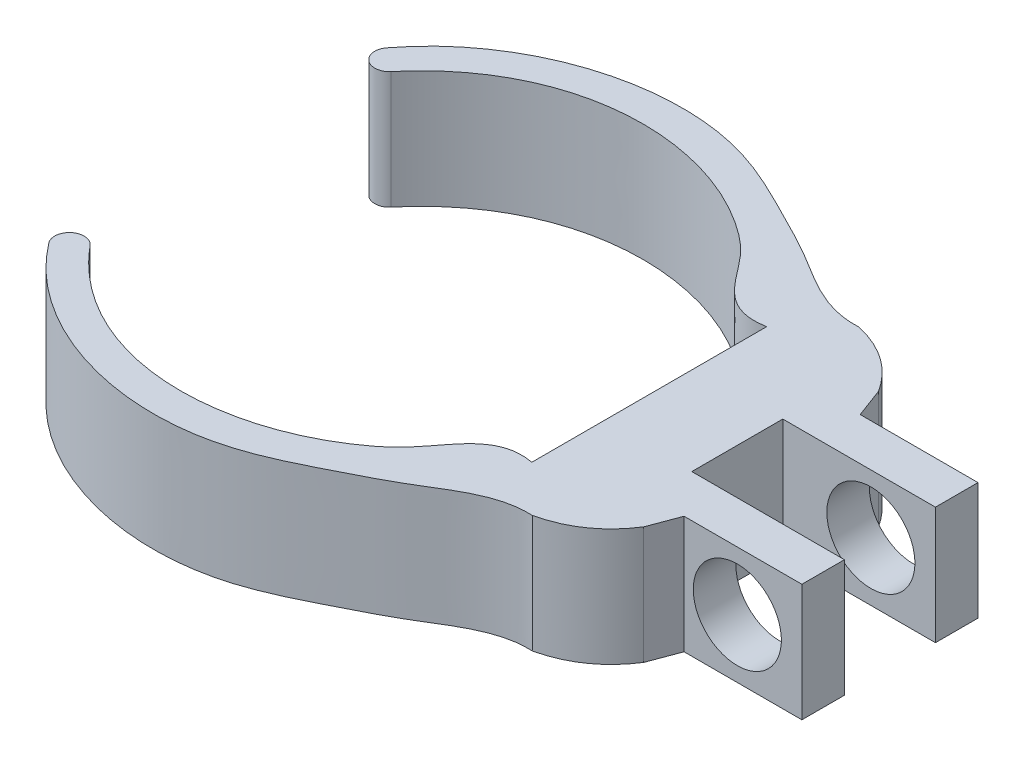
ISO-10303-21;
HEADER;
FILE_DESCRIPTION(('STEP AP214'),'2;1');
FILE_NAME('part.step','',(''),(''),'','','');
FILE_SCHEMA(('AUTOMOTIVE_DESIGN { 1 0 10303 214 1 1 1 1 }'));
ENDSEC;
DATA;
#1=APPLICATION_CONTEXT('core data for automotive mechanical design processes');
#2=APPLICATION_PROTOCOL_DEFINITION('international standard','automotive_design',2000,#1);
#3=PRODUCT_CONTEXT('',#1,'mechanical');
#4=PRODUCT('Part','Part','',(#3));
#5=PRODUCT_RELATED_PRODUCT_CATEGORY('part','',(#4));
#6=PRODUCT_DEFINITION_FORMATION('','',#4);
#7=PRODUCT_DEFINITION_CONTEXT('part definition',#1,'design');
#8=PRODUCT_DEFINITION('design','',#6,#7);
#9=PRODUCT_DEFINITION_SHAPE('','',#8);
#10=(LENGTH_UNIT() NAMED_UNIT(*) SI_UNIT(.MILLI.,.METRE.));
#11=(NAMED_UNIT(*) PLANE_ANGLE_UNIT() SI_UNIT($,.RADIAN.));
#12=(NAMED_UNIT(*) SI_UNIT($,.STERADIAN.) SOLID_ANGLE_UNIT());
#13=UNCERTAINTY_MEASURE_WITH_UNIT(LENGTH_MEASURE(1.E-05),#10,'distance_accuracy_value','');
#14=(GEOMETRIC_REPRESENTATION_CONTEXT(3) GLOBAL_UNCERTAINTY_ASSIGNED_CONTEXT((#13)) GLOBAL_UNIT_ASSIGNED_CONTEXT((#10,
#11,#12)) REPRESENTATION_CONTEXT('',''));
#15=CARTESIAN_POINT('',(0.,0.,0.));
#16=DIRECTION('',(0.,0.,1.));
#17=DIRECTION('',(1.,0.,0.));
#18=AXIS2_PLACEMENT_3D('',#15,#16,#17);
#19=CARTESIAN_POINT('',(0.,4.,-7.));
#20=DIRECTION('',(0.,0.,-1.));
#21=DIRECTION('',(-1.,0.,0.));
#22=AXIS2_PLACEMENT_3D('',#19,#20,#21);
#23=PLANE('',#22);
#24=CARTESIAN_POINT('',(6.,2.,-7.));
#25=DIRECTION('',(0.,0.,-1.));
#26=DIRECTION('',(-1.,0.,0.));
#27=AXIS2_PLACEMENT_3D('',#24,#25,#26);
#28=CIRCLE('',#27,1.5);
#29=CARTESIAN_POINT('',(4.5,2.,-7.));
#30=VERTEX_POINT('',#29);
#31=EDGE_CURVE('E195',#30,#30,#28,.F.);
#32=ORIENTED_EDGE('',*,*,#31,.T.);
#33=EDGE_LOOP('',(#32));
#34=FACE_BOUND('',#33,.T.);
#35=DIRECTION('',(1.,0.,0.));
#36=VECTOR('',#35,1.);
#37=CARTESIAN_POINT('',(0.,0.,-7.));
#38=LINE('',#37,#36);
#39=CARTESIAN_POINT('',(4.18582899350668,0.,-7.));
#40=VERTEX_POINT('',#39);
#41=CARTESIAN_POINT('',(8.2,0.,-7.));
#42=VERTEX_POINT('',#41);
#43=EDGE_CURVE('E192',#40,#42,#38,.T.);
#44=ORIENTED_EDGE('',*,*,#43,.F.);
#45=DIRECTION('',(0.,-1.,0.));
#46=VECTOR('',#45,1.);
#47=CARTESIAN_POINT('',(4.18582899350668,4.,-7.));
#48=LINE('',#47,#46);
#49=CARTESIAN_POINT('',(4.18582899350668,4.,-7.));
#50=VERTEX_POINT('',#49);
#51=EDGE_CURVE('E11',#50,#40,#48,.T.);
#52=ORIENTED_EDGE('',*,*,#51,.F.);
#53=DIRECTION('',(1.,0.,0.));
#54=VECTOR('',#53,1.);
#55=CARTESIAN_POINT('',(0.,4.,-7.));
#56=LINE('',#55,#54);
#57=CARTESIAN_POINT('',(8.2,4.,-7.));
#58=VERTEX_POINT('',#57);
#59=EDGE_CURVE('E268',#50,#58,#56,.T.);
#60=ORIENTED_EDGE('',*,*,#59,.T.);
#61=DIRECTION('',(0.,-1.,0.));
#62=VECTOR('',#61,1.);
#63=CARTESIAN_POINT('',(8.2,4.,-7.));
#64=LINE('',#63,#62);
#65=EDGE_CURVE('E54',#58,#42,#64,.T.);
#66=ORIENTED_EDGE('',*,*,#65,.T.);
#67=EDGE_LOOP('',(#44,#52,#60,#66));
#68=FACE_BOUND('',#67,.T.);
#69=ADVANCED_FACE('F37',(#34,#68),#23,.T.);
#70=CARTESIAN_POINT('',(5.96743312681349,4.,-2.22783787352512));
#71=DIRECTION('',(0.93684171159895,0.,-0.349753638163136));
#72=DIRECTION('',(-0.349753638163136,0.,-0.93684171159895));
#73=AXIS2_PLACEMENT_3D('',#70,#71,#72);
#74=PLANE('',#73);
#75=DIRECTION('',(0.349753638163136,0.,0.93684171159895));
#76=VECTOR('',#75,1.);
#77=CARTESIAN_POINT('',(5.96743312681349,0.,-2.22783787352512));
#78=LINE('',#77,#76);
#79=CARTESIAN_POINT('',(3.81249630151307,0.,-8.));
#80=VERTEX_POINT('',#79);
#81=EDGE_CURVE('E194',#80,#40,#78,.T.);
#82=ORIENTED_EDGE('',*,*,#81,.F.);
#83=DIRECTION('',(0.,-1.,0.));
#84=VECTOR('',#83,1.);
#85=CARTESIAN_POINT('',(3.81249630151307,4.,-8.));
#86=LINE('',#85,#84);
#87=CARTESIAN_POINT('',(3.81249630151307,4.,-8.));
#88=VERTEX_POINT('',#87);
#89=EDGE_CURVE('E46',#88,#80,#86,.T.);
#90=ORIENTED_EDGE('',*,*,#89,.F.);
#91=DIRECTION('',(0.349753638163136,0.,0.93684171159895));
#92=VECTOR('',#91,1.);
#93=CARTESIAN_POINT('',(5.96743312681349,4.,-2.22783787352512));
#94=LINE('',#93,#92);
#95=EDGE_CURVE('E322',#88,#50,#94,.T.);
#96=ORIENTED_EDGE('',*,*,#95,.T.);
#97=ORIENTED_EDGE('',*,*,#51,.T.);
#98=EDGE_LOOP('',(#82,#90,#96,#97));
#99=FACE_BOUND('',#98,.T.);
#100=ADVANCED_FACE('F311',(#99),#74,.T.);
#101=CARTESIAN_POINT('',(1.579778316785,4.,-9.56066150238347));
#102=CARTESIAN_POINT('',(3.01637188256581,4.,-9.23196193005216));
#103=CARTESIAN_POINT('',(3.81249630151308,4.,-8.));
#104=B_SPLINE_CURVE_WITH_KNOTS('',2,(#101,#102,#103),.UNSPECIFIED.,.F.,.F.,(3,3),(0.,1.),.UNSPECIFIED.);
#105=DIRECTION('',(0.,-1.,0.));
#106=VECTOR('',#105,1.);
#107=SURFACE_OF_LINEAR_EXTRUSION('',#104,#106);
#108=CARTESIAN_POINT('',(1.579778316785,0.,-9.56066150238347));
#109=CARTESIAN_POINT('',(3.01637188256581,0.,-9.23196193005216));
#110=CARTESIAN_POINT('',(3.81249630151308,0.,-8.));
#111=B_SPLINE_CURVE_WITH_KNOTS('',2,(#108,#109,#110),.UNSPECIFIED.,.F.,.F.,(3,3),(0.,1.),.UNSPECIFIED.);
#112=CARTESIAN_POINT('',(1.579778316785,0.,-9.56066150238347));
#113=VERTEX_POINT('',#112);
#114=EDGE_CURVE('E198',#113,#80,#111,.T.);
#115=ORIENTED_EDGE('',*,*,#114,.F.);
#116=DIRECTION('',(0.,-1.,0.));
#117=VECTOR('',#116,1.);
#118=CARTESIAN_POINT('',(1.579778316785,4.,-9.56066150238347));
#119=LINE('',#118,#117);
#120=CARTESIAN_POINT('',(1.579778316785,4.,-9.56066150238347));
#121=VERTEX_POINT('',#120);
#122=EDGE_CURVE('E299',#121,#113,#119,.T.);
#123=ORIENTED_EDGE('',*,*,#122,.F.);
#124=EDGE_CURVE('E307',#121,#88,#104,.T.);
#125=ORIENTED_EDGE('',*,*,#124,.T.);
#126=ORIENTED_EDGE('',*,*,#89,.T.);
#127=EDGE_LOOP('',(#115,#123,#125,#126));
#128=FACE_BOUND('',#127,.T.);
#129=ADVANCED_FACE('F305',(#128),#107,.T.);
#130=CARTESIAN_POINT('',(-14.6796449934747,4.,-9.77947622002646));
#131=CARTESIAN_POINT('',(-12.6288944529096,4.,-12.4740809792739));
#132=CARTESIAN_POINT('',(-7.71429631155654,4.,-13.951404509586));
#133=CARTESIAN_POINT('',(-3.34534030952829,4.,-11.740062440401));
#134=CARTESIAN_POINT('',(-1.00563164103133,4.,-10.5601854078919));
#135=CARTESIAN_POINT('',(0.39459532488585,4.,-9.50115309346869));
#136=CARTESIAN_POINT('',(1.579778316785,4.,-9.56066150238347));
#137=B_SPLINE_CURVE_WITH_KNOTS('',3,(#130,#131,#132,#133,#134,#135,#136),.UNSPECIFIED.,.F.,.F.,
(4,1,1,1,4),(0.,0.557352672097069,0.711946672573447,0.815566184702698,1.),.UNSPECIFIED.);
#138=DIRECTION('',(0.,-1.,0.));
#139=VECTOR('',#138,1.);
#140=SURFACE_OF_LINEAR_EXTRUSION('',#137,#139);
#141=CARTESIAN_POINT('',(-14.6796449934747,0.,-9.77947622002646));
#142=CARTESIAN_POINT('',(-12.6288944529096,0.,-12.4740809792739));
#143=CARTESIAN_POINT('',(-7.71429631155654,0.,-13.951404509586));
#144=CARTESIAN_POINT('',(-3.34534030952829,0.,-11.740062440401));
#145=CARTESIAN_POINT('',(-1.00563164103133,0.,-10.5601854078919));
#146=CARTESIAN_POINT('',(0.39459532488585,0.,-9.50115309346869));
#147=CARTESIAN_POINT('',(1.579778316785,0.,-9.56066150238347));
#148=B_SPLINE_CURVE_WITH_KNOTS('',3,(#141,#142,#143,#144,#145,#146,#147),.UNSPECIFIED.,.F.,.F.,
(4,1,1,1,4),(0.,0.557352672097069,0.711946672573447,0.815566184702698,1.),.UNSPECIFIED.);
#149=CARTESIAN_POINT('',(-14.6796449934747,0.,-9.77947622002647));
#150=VERTEX_POINT('',#149);
#151=EDGE_CURVE('E203',#150,#113,#148,.T.);
#152=ORIENTED_EDGE('',*,*,#151,.F.);
#153=DIRECTION('',(0.,-1.,0.));
#154=VECTOR('',#153,1.);
#155=CARTESIAN_POINT('',(-14.6796449934747,4.,-9.77947622002647));
#156=LINE('',#155,#154);
#157=CARTESIAN_POINT('',(-14.6796449934747,4.,-9.77947622002647));
#158=VERTEX_POINT('',#157);
#159=EDGE_CURVE('E297',#158,#150,#156,.T.);
#160=ORIENTED_EDGE('',*,*,#159,.F.);
#161=EDGE_CURVE('E321',#158,#121,#137,.T.);
#162=ORIENTED_EDGE('',*,*,#161,.T.);
#163=ORIENTED_EDGE('',*,*,#122,.T.);
#164=EDGE_LOOP('',(#152,#160,#162,#163));
#165=FACE_BOUND('',#164,.T.);
#166=ADVANCED_FACE('F317',(#165),#140,.T.);
#167=CARTESIAN_POINT('',(-14.301533041483,4.,-9.45231975629542));
#168=DIRECTION('',(0.,-1.,0.));
#169=DIRECTION('',(0.,0.,-1.));
#170=AXIS2_PLACEMENT_3D('',#167,#168,#169);
#171=CYLINDRICAL_SURFACE('',#170,0.499999999999999);
#172=CARTESIAN_POINT('',(-14.301533041483,0.,-9.45231975629542));
#173=DIRECTION('',(0.,1.,0.));
#174=DIRECTION('',(0.,0.,1.));
#175=AXIS2_PLACEMENT_3D('',#172,#173,#174);
#176=CIRCLE('',#175,0.499999999999999);
#177=CARTESIAN_POINT('',(-13.9234210894912,0.,-9.12516329256437));
#178=VERTEX_POINT('',#177);
#179=EDGE_CURVE('E211',#150,#178,#176,.T.);
#180=ORIENTED_EDGE('',*,*,#179,.T.);
#181=DIRECTION('',(0.,-1.,0.));
#182=VECTOR('',#181,1.);
#183=CARTESIAN_POINT('',(-13.9234210894912,4.,-9.12516329256437));
#184=LINE('',#183,#182);
#185=CARTESIAN_POINT('',(-13.9234210894912,4.,-9.12516329256437));
#186=VERTEX_POINT('',#185);
#187=EDGE_CURVE('E295',#186,#178,#184,.T.);
#188=ORIENTED_EDGE('',*,*,#187,.F.);
#189=CARTESIAN_POINT('',(-14.301533041483,4.,-9.45231975629542));
#190=DIRECTION('',(0.,1.,0.));
#191=DIRECTION('',(0.,0.,1.));
#192=AXIS2_PLACEMENT_3D('',#189,#190,#191);
#193=CIRCLE('',#192,0.499999999999999);
#194=EDGE_CURVE('E324',#158,#186,#193,.T.);
#195=ORIENTED_EDGE('',*,*,#194,.F.);
#196=ORIENTED_EDGE('',*,*,#159,.T.);
#197=EDGE_LOOP('',(#180,#188,#195,#196));
#198=FACE_BOUND('',#197,.T.);
#199=ADVANCED_FACE('F447',(#198),#171,.T.);
#200=CARTESIAN_POINT('',(0.,4.,-8.));
#201=CARTESIAN_POINT('',(-1.44497211346418,4.,-7.73163506053914));
#202=CARTESIAN_POINT('',(-1.98977866941509,4.,-9.27479361128934));
#203=CARTESIAN_POINT('',(-5.99641861973722,4.,-12.5324767542509));
#204=CARTESIAN_POINT('',(-11.0435793264746,4.,-12.5964127519181));
#205=CARTESIAN_POINT('',(-13.9234210894912,4.,-9.12516329256436));
#206=B_SPLINE_CURVE_WITH_KNOTS('',3,(#200,#201,#202,#203,#204,#205),.UNSPECIFIED.,.F.,.F.,(4,1,
1,4),(0.,0.216898357421302,0.270831115761617,1.),.UNSPECIFIED.);
#207=DIRECTION('',(0.,-1.,0.));
#208=VECTOR('',#207,1.);
#209=SURFACE_OF_LINEAR_EXTRUSION('',#206,#208);
#210=CARTESIAN_POINT('',(0.,0.,-8.));
#211=CARTESIAN_POINT('',(-1.44497211346418,0.,-7.73163506053914));
#212=CARTESIAN_POINT('',(-1.98977866941509,0.,-9.27479361128934));
#213=CARTESIAN_POINT('',(-5.99641861973722,0.,-12.5324767542509));
#214=CARTESIAN_POINT('',(-11.0435793264746,0.,-12.5964127519181));
#215=CARTESIAN_POINT('',(-13.9234210894912,0.,-9.12516329256436));
#216=B_SPLINE_CURVE_WITH_KNOTS('',3,(#210,#211,#212,#213,#214,#215),.UNSPECIFIED.,.F.,.F.,(4,1,
1,4),(0.,0.216898357421302,0.270831115761617,1.),.UNSPECIFIED.);
#217=CARTESIAN_POINT('',(0.,0.,-8.));
#218=VERTEX_POINT('',#217);
#219=EDGE_CURVE('E217',#218,#178,#216,.T.);
#220=ORIENTED_EDGE('',*,*,#219,.F.);
#221=DIRECTION('',(0.,-1.,0.));
#222=VECTOR('',#221,1.);
#223=CARTESIAN_POINT('',(0.,4.,-8.));
#224=LINE('',#223,#222);
#225=CARTESIAN_POINT('',(0.,4.,-8.));
#226=VERTEX_POINT('',#225);
#227=EDGE_CURVE('E293',#226,#218,#224,.T.);
#228=ORIENTED_EDGE('',*,*,#227,.F.);
#229=EDGE_CURVE('E445',#226,#186,#206,.T.);
#230=ORIENTED_EDGE('',*,*,#229,.T.);
#231=ORIENTED_EDGE('',*,*,#187,.T.);
#232=EDGE_LOOP('',(#220,#228,#230,#231));
#233=FACE_BOUND('',#232,.T.);
#234=ADVANCED_FACE('F440',(#233),#209,.T.);
#235=CARTESIAN_POINT('',(0.,4.,0.));
#236=DIRECTION('',(1.,0.,0.));
#237=DIRECTION('',(0.,0.,-1.));
#238=AXIS2_PLACEMENT_3D('',#235,#236,#237);
#239=PLANE('',#238);
#240=DIRECTION('',(0.,0.,1.));
#241=VECTOR('',#240,1.);
#242=CARTESIAN_POINT('',(0.,0.,0.));
#243=LINE('',#242,#241);
#244=CARTESIAN_POINT('',(0.,0.,0.));
#245=VERTEX_POINT('',#244);
#246=EDGE_CURVE('E222',#218,#245,#243,.T.);
#247=ORIENTED_EDGE('',*,*,#246,.T.);
#248=DIRECTION('',(0.,-1.,0.));
#249=VECTOR('',#248,1.);
#250=CARTESIAN_POINT('',(0.,4.,0.));
#251=LINE('',#250,#249);
#252=CARTESIAN_POINT('',(0.,4.,0.));
#253=VERTEX_POINT('',#252);
#254=EDGE_CURVE('E290',#253,#245,#251,.T.);
#255=ORIENTED_EDGE('',*,*,#254,.F.);
#256=DIRECTION('',(0.,0.,1.));
#257=VECTOR('',#256,1.);
#258=CARTESIAN_POINT('',(0.,4.,0.));
#259=LINE('',#258,#257);
#260=EDGE_CURVE('E448',#226,#253,#259,.T.);
#261=ORIENTED_EDGE('',*,*,#260,.F.);
#262=ORIENTED_EDGE('',*,*,#227,.T.);
#263=EDGE_LOOP('',(#247,#255,#261,#262));
#264=FACE_BOUND('',#263,.T.);
#265=ADVANCED_FACE('F461',(#264),#239,.F.);
#266=CARTESIAN_POINT('',(0.,4.,0.));
#267=CARTESIAN_POINT('',(-1.44497211346418,4.,-0.268364939460865));
#268=CARTESIAN_POINT('',(-1.98977866941509,4.,1.27479361128934));
#269=CARTESIAN_POINT('',(-5.99641861973722,4.,4.53247675425091));
#270=CARTESIAN_POINT('',(-11.0435793264746,4.,4.5964127519181));
#271=CARTESIAN_POINT('',(-13.9234210894912,4.,1.12516329256436));
#272=B_SPLINE_CURVE_WITH_KNOTS('',3,(#266,#267,#268,#269,#270,#271),.UNSPECIFIED.,.F.,.F.,(4,1,
1,4),(0.,0.216898357421302,0.270831115761617,1.),.UNSPECIFIED.);
#273=DIRECTION('',(0.,-1.,0.));
#274=VECTOR('',#273,1.);
#275=SURFACE_OF_LINEAR_EXTRUSION('',#272,#274);
#276=CARTESIAN_POINT('',(0.,0.,0.));
#277=CARTESIAN_POINT('',(-1.44497211346418,0.,-0.268364939460865));
#278=CARTESIAN_POINT('',(-1.98977866941509,0.,1.27479361128934));
#279=CARTESIAN_POINT('',(-5.99641861973722,0.,4.53247675425091));
#280=CARTESIAN_POINT('',(-11.0435793264746,0.,4.5964127519181));
#281=CARTESIAN_POINT('',(-13.9234210894912,0.,1.12516329256436));
#282=B_SPLINE_CURVE_WITH_KNOTS('',3,(#276,#277,#278,#279,#280,#281),.UNSPECIFIED.,.F.,.F.,(4,1,
1,4),(0.,0.216898357421302,0.270831115761617,1.),.UNSPECIFIED.);
#283=CARTESIAN_POINT('',(-13.9234210894912,0.,1.12516329256438));
#284=VERTEX_POINT('',#283);
#285=EDGE_CURVE('E227',#245,#284,#282,.T.);
#286=ORIENTED_EDGE('',*,*,#285,.T.);
#287=DIRECTION('',(0.,-1.,0.));
#288=VECTOR('',#287,1.);
#289=CARTESIAN_POINT('',(-13.9234210894912,4.,1.12516329256438));
#290=LINE('',#289,#288);
#291=CARTESIAN_POINT('',(-13.9234210894912,4.,1.12516329256438));
#292=VERTEX_POINT('',#291);
#293=EDGE_CURVE('E288',#292,#284,#290,.T.);
#294=ORIENTED_EDGE('',*,*,#293,.F.);
#295=EDGE_CURVE('E619',#253,#292,#272,.T.);
#296=ORIENTED_EDGE('',*,*,#295,.F.);
#297=ORIENTED_EDGE('',*,*,#254,.T.);
#298=EDGE_LOOP('',(#286,#294,#296,#297));
#299=FACE_BOUND('',#298,.T.);
#300=ADVANCED_FACE('F434',(#299),#275,.F.);
#301=CARTESIAN_POINT('',(-14.301533041483,4.,1.45231975629542));
#302=DIRECTION('',(0.,-1.,0.));
#303=DIRECTION('',(0.,0.,-1.));
#304=AXIS2_PLACEMENT_3D('',#301,#302,#303);
#305=CYLINDRICAL_SURFACE('',#304,0.499999999999999);
#306=CARTESIAN_POINT('',(-14.301533041483,0.,1.45231975629542));
#307=DIRECTION('',(0.,1.,0.));
#308=DIRECTION('',(0.,0.,1.));
#309=AXIS2_PLACEMENT_3D('',#306,#307,#308);
#310=CIRCLE('',#309,0.499999999999999);
#311=CARTESIAN_POINT('',(-14.6796449934747,0.,1.77947622002647));
#312=VERTEX_POINT('',#311);
#313=EDGE_CURVE('E232',#312,#284,#310,.F.);
#314=ORIENTED_EDGE('',*,*,#313,.F.);
#315=DIRECTION('',(0.,-1.,0.));
#316=VECTOR('',#315,1.);
#317=CARTESIAN_POINT('',(-14.6796449934747,4.,1.77947622002647));
#318=LINE('',#317,#316);
#319=CARTESIAN_POINT('',(-14.6796449934747,4.,1.77947622002647));
#320=VERTEX_POINT('',#319);
#321=EDGE_CURVE('E286',#320,#312,#318,.T.);
#322=ORIENTED_EDGE('',*,*,#321,.F.);
#323=CARTESIAN_POINT('',(-14.301533041483,4.,1.45231975629542));
#324=DIRECTION('',(0.,1.,0.));
#325=DIRECTION('',(0.,0.,1.));
#326=AXIS2_PLACEMENT_3D('',#323,#324,#325);
#327=CIRCLE('',#326,0.499999999999999);
#328=EDGE_CURVE('E431',#320,#292,#327,.F.);
#329=ORIENTED_EDGE('',*,*,#328,.T.);
#330=ORIENTED_EDGE('',*,*,#293,.T.);
#331=EDGE_LOOP('',(#314,#322,#329,#330));
#332=FACE_BOUND('',#331,.T.);
#333=ADVANCED_FACE('F426',(#332),#305,.T.);
#334=CARTESIAN_POINT('',(-14.6796449934747,4.,1.77947622002646));
#335=CARTESIAN_POINT('',(-12.6288944529096,4.,4.4740809792739));
#336=CARTESIAN_POINT('',(-7.71429631155654,4.,5.95140450958604));
#337=CARTESIAN_POINT('',(-3.34534030952829,4.,3.74006244040104));
#338=CARTESIAN_POINT('',(-1.00563164103133,4.,2.56018540789194));
#339=CARTESIAN_POINT('',(0.39459532488585,4.,1.50115309346869));
#340=CARTESIAN_POINT('',(1.579778316785,4.,1.56066150238347));
#341=B_SPLINE_CURVE_WITH_KNOTS('',3,(#334,#335,#336,#337,#338,#339,#340),.UNSPECIFIED.,.F.,.F.,
(4,1,1,1,4),(0.,0.557352672097069,0.711946672573447,0.815566184702698,1.),.UNSPECIFIED.);
#342=DIRECTION('',(0.,-1.,0.));
#343=VECTOR('',#342,1.);
#344=SURFACE_OF_LINEAR_EXTRUSION('',#341,#343);
#345=CARTESIAN_POINT('',(-14.6796449934747,0.,1.77947622002646));
#346=CARTESIAN_POINT('',(-12.6288944529096,0.,4.4740809792739));
#347=CARTESIAN_POINT('',(-7.71429631155654,0.,5.95140450958604));
#348=CARTESIAN_POINT('',(-3.34534030952829,0.,3.74006244040104));
#349=CARTESIAN_POINT('',(-1.00563164103133,0.,2.56018540789194));
#350=CARTESIAN_POINT('',(0.39459532488585,0.,1.50115309346869));
#351=CARTESIAN_POINT('',(1.579778316785,0.,1.56066150238347));
#352=B_SPLINE_CURVE_WITH_KNOTS('',3,(#345,#346,#347,#348,#349,#350,#351),.UNSPECIFIED.,.F.,.F.,
(4,1,1,1,4),(0.,0.557352672097069,0.711946672573447,0.815566184702698,1.),.UNSPECIFIED.);
#353=CARTESIAN_POINT('',(1.579778316785,0.,1.56066150238347));
#354=VERTEX_POINT('',#353);
#355=EDGE_CURVE('E238',#312,#354,#352,.T.);
#356=ORIENTED_EDGE('',*,*,#355,.T.);
#357=DIRECTION('',(0.,-1.,0.));
#358=VECTOR('',#357,1.);
#359=CARTESIAN_POINT('',(1.579778316785,4.,1.56066150238347));
#360=LINE('',#359,#358);
#361=CARTESIAN_POINT('',(1.579778316785,4.,1.56066150238347));
#362=VERTEX_POINT('',#361);
#363=EDGE_CURVE('E283',#362,#354,#360,.T.);
#364=ORIENTED_EDGE('',*,*,#363,.F.);
#365=EDGE_CURVE('E395',#320,#362,#341,.T.);
#366=ORIENTED_EDGE('',*,*,#365,.F.);
#367=ORIENTED_EDGE('',*,*,#321,.T.);
#368=EDGE_LOOP('',(#356,#364,#366,#367));
#369=FACE_BOUND('',#368,.T.);
#370=ADVANCED_FACE('F385',(#369),#344,.F.);
#371=CARTESIAN_POINT('',(1.579778316785,4.,1.56066150238347));
#372=CARTESIAN_POINT('',(3.01637188256581,4.,1.23196193005216));
#373=CARTESIAN_POINT('',(3.81249630151308,4.,0.));
#374=B_SPLINE_CURVE_WITH_KNOTS('',2,(#371,#372,#373),.UNSPECIFIED.,.F.,.F.,(3,3),(0.,1.),.UNSPECIFIED.);
#375=DIRECTION('',(0.,-1.,0.));
#376=VECTOR('',#375,1.);
#377=SURFACE_OF_LINEAR_EXTRUSION('',#374,#376);
#378=CARTESIAN_POINT('',(1.579778316785,0.,1.56066150238347));
#379=CARTESIAN_POINT('',(3.01637188256581,0.,1.23196193005216));
#380=CARTESIAN_POINT('',(3.81249630151308,0.,0.));
#381=B_SPLINE_CURVE_WITH_KNOTS('',2,(#378,#379,#380),.UNSPECIFIED.,.F.,.F.,(3,3),(0.,1.),.UNSPECIFIED.);
#382=CARTESIAN_POINT('',(3.81249630151308,0.,0.));
#383=VERTEX_POINT('',#382);
#384=EDGE_CURVE('E242',#354,#383,#381,.T.);
#385=ORIENTED_EDGE('',*,*,#384,.T.);
#386=DIRECTION('',(0.,-1.,0.));
#387=VECTOR('',#386,1.);
#388=CARTESIAN_POINT('',(3.81249630151308,4.,0.));
#389=LINE('',#388,#387);
#390=CARTESIAN_POINT('',(3.81249630151308,4.,0.));
#391=VERTEX_POINT('',#390);
#392=EDGE_CURVE('E280',#391,#383,#389,.T.);
#393=ORIENTED_EDGE('',*,*,#392,.F.);
#394=EDGE_CURVE('E389',#362,#391,#374,.T.);
#395=ORIENTED_EDGE('',*,*,#394,.F.);
#396=ORIENTED_EDGE('',*,*,#363,.T.);
#397=EDGE_LOOP('',(#385,#393,#395,#396));
#398=FACE_BOUND('',#397,.T.);
#399=ADVANCED_FACE('F380',(#398),#377,.F.);
#400=CARTESIAN_POINT('',(3.3461227506958,4.,1.24921701425832));
#401=DIRECTION('',(-0.93684171159895,0.,-0.349753638163136));
#402=DIRECTION('',(-0.349753638163136,0.,0.93684171159895));
#403=AXIS2_PLACEMENT_3D('',#400,#401,#402);
#404=PLANE('',#403);
#405=DIRECTION('',(0.349753638163136,0.,-0.93684171159895));
#406=VECTOR('',#405,1.);
#407=CARTESIAN_POINT('',(3.3461227506958,0.,1.24921701425832));
#408=LINE('',#407,#406);
#409=CARTESIAN_POINT('',(4.18582899350668,0.,-1.));
#410=VERTEX_POINT('',#409);
#411=EDGE_CURVE('E249',#383,#410,#408,.T.);
#412=ORIENTED_EDGE('',*,*,#411,.T.);
#413=DIRECTION('',(0.,-1.,0.));
#414=VECTOR('',#413,1.);
#415=CARTESIAN_POINT('',(4.18582899350668,4.,-1.));
#416=LINE('',#415,#414);
#417=CARTESIAN_POINT('',(4.18582899350668,4.,-1.));
#418=VERTEX_POINT('',#417);
#419=EDGE_CURVE('E277',#418,#410,#416,.T.);
#420=ORIENTED_EDGE('',*,*,#419,.F.);
#421=DIRECTION('',(0.349753638163136,0.,-0.93684171159895));
#422=VECTOR('',#421,1.);
#423=CARTESIAN_POINT('',(3.3461227506958,4.,1.24921701425832));
#424=LINE('',#423,#422);
#425=EDGE_CURVE('E394',#391,#418,#424,.T.);
#426=ORIENTED_EDGE('',*,*,#425,.F.);
#427=ORIENTED_EDGE('',*,*,#392,.T.);
#428=EDGE_LOOP('',(#412,#420,#426,#427));
#429=FACE_BOUND('',#428,.T.);
#430=ADVANCED_FACE('F376',(#429),#404,.F.);
#431=CARTESIAN_POINT('',(0.,4.,-1.));
#432=DIRECTION('',(0.,0.,-1.));
#433=DIRECTION('',(-1.,0.,0.));
#434=AXIS2_PLACEMENT_3D('',#431,#432,#433);
#435=PLANE('',#434);
#436=CARTESIAN_POINT('',(6.,2.,-1.));
#437=DIRECTION('',(0.,0.,-1.));
#438=DIRECTION('',(-1.,0.,0.));
#439=AXIS2_PLACEMENT_3D('',#436,#437,#438);
#440=CIRCLE('',#439,1.5);
#441=CARTESIAN_POINT('',(4.5,2.,-1.));
#442=VERTEX_POINT('',#441);
#443=EDGE_CURVE('E538',#442,#442,#440,.F.);
#444=ORIENTED_EDGE('',*,*,#443,.F.);
#445=EDGE_LOOP('',(#444));
#446=FACE_BOUND('',#445,.T.);
#447=DIRECTION('',(1.,0.,0.));
#448=VECTOR('',#447,1.);
#449=CARTESIAN_POINT('',(0.,0.,-1.));
#450=LINE('',#449,#448);
#451=CARTESIAN_POINT('',(8.2,0.,-1.));
#452=VERTEX_POINT('',#451);
#453=EDGE_CURVE('E254',#410,#452,#450,.T.);
#454=ORIENTED_EDGE('',*,*,#453,.T.);
#455=DIRECTION('',(0.,-1.,0.));
#456=VECTOR('',#455,1.);
#457=CARTESIAN_POINT('',(8.2,4.,-1.));
#458=LINE('',#457,#456);
#459=CARTESIAN_POINT('',(8.2,4.,-1.));
#460=VERTEX_POINT('',#459);
#461=EDGE_CURVE('E274',#460,#452,#458,.T.);
#462=ORIENTED_EDGE('',*,*,#461,.F.);
#463=DIRECTION('',(1.,0.,0.));
#464=VECTOR('',#463,1.);
#465=CARTESIAN_POINT('',(0.,4.,-1.));
#466=LINE('',#465,#464);
#467=EDGE_CURVE('E404',#418,#460,#466,.T.);
#468=ORIENTED_EDGE('',*,*,#467,.F.);
#469=ORIENTED_EDGE('',*,*,#419,.T.);
#470=EDGE_LOOP('',(#454,#462,#468,#469));
#471=FACE_BOUND('',#470,.T.);
#472=ADVANCED_FACE('F372',(#446,#471),#435,.F.);
#473=CARTESIAN_POINT('',(8.2,4.,0.));
#474=DIRECTION('',(-1.,0.,0.));
#475=DIRECTION('',(0.,0.,1.));
#476=AXIS2_PLACEMENT_3D('',#473,#474,#475);
#477=PLANE('',#476);
#478=DIRECTION('',(0.,0.,-1.));
#479=VECTOR('',#478,1.);
#480=CARTESIAN_POINT('',(8.2,0.,0.));
#481=LINE('',#480,#479);
#482=CARTESIAN_POINT('',(8.2,0.,-2.45));
#483=VERTEX_POINT('',#482);
#484=EDGE_CURVE('E256',#452,#483,#481,.T.);
#485=ORIENTED_EDGE('',*,*,#484,.T.);
#486=DIRECTION('',(0.,-1.,0.));
#487=VECTOR('',#486,1.);
#488=CARTESIAN_POINT('',(8.2,4.,-2.45));
#489=LINE('',#488,#487);
#490=CARTESIAN_POINT('',(8.2,4.,-2.45));
#491=VERTEX_POINT('',#490);
#492=EDGE_CURVE('E272',#491,#483,#489,.T.);
#493=ORIENTED_EDGE('',*,*,#492,.F.);
#494=DIRECTION('',(0.,0.,-1.));
#495=VECTOR('',#494,1.);
#496=CARTESIAN_POINT('',(8.2,4.,0.));
#497=LINE('',#496,#495);
#498=EDGE_CURVE('E187',#460,#491,#497,.T.);
#499=ORIENTED_EDGE('',*,*,#498,.F.);
#500=ORIENTED_EDGE('',*,*,#461,.T.);
#501=EDGE_LOOP('',(#485,#493,#499,#500));
#502=FACE_BOUND('',#501,.T.);
#503=ADVANCED_FACE('F368',(#502),#477,.F.);
#504=CARTESIAN_POINT('',(0.,4.,-2.45));
#505=DIRECTION('',(0.,0.,-1.));
#506=DIRECTION('',(-1.,0.,0.));
#507=AXIS2_PLACEMENT_3D('',#504,#505,#506);
#508=PLANE('',#507);
#509=CARTESIAN_POINT('',(6.,2.,-2.45));
#510=DIRECTION('',(0.,0.,-1.));
#511=DIRECTION('',(-1.,0.,0.));
#512=AXIS2_PLACEMENT_3D('',#509,#510,#511);
#513=CIRCLE('',#512,1.5);
#514=CARTESIAN_POINT('',(4.5,2.,-2.45));
#515=VERTEX_POINT('',#514);
#516=EDGE_CURVE('E535',#515,#515,#513,.F.);
#517=ORIENTED_EDGE('',*,*,#516,.T.);
#518=EDGE_LOOP('',(#517));
#519=FACE_BOUND('',#518,.T.);
#520=DIRECTION('',(1.,0.,0.));
#521=VECTOR('',#520,1.);
#522=CARTESIAN_POINT('',(0.,0.,-2.45));
#523=LINE('',#522,#521);
#524=CARTESIAN_POINT('',(3.,0.,-2.45));
#525=VERTEX_POINT('',#524);
#526=EDGE_CURVE('E259',#525,#483,#523,.T.);
#527=ORIENTED_EDGE('',*,*,#526,.F.);
#528=DIRECTION('',(0.,-1.,0.));
#529=VECTOR('',#528,1.);
#530=CARTESIAN_POINT('',(3.,4.,-2.45));
#531=LINE('',#530,#529);
#532=CARTESIAN_POINT('',(3.,4.,-2.45));
#533=VERTEX_POINT('',#532);
#534=EDGE_CURVE('E174',#533,#525,#531,.T.);
#535=ORIENTED_EDGE('',*,*,#534,.F.);
#536=DIRECTION('',(1.,0.,0.));
#537=VECTOR('',#536,1.);
#538=CARTESIAN_POINT('',(0.,4.,-2.45));
#539=LINE('',#538,#537);
#540=EDGE_CURVE('E185',#533,#491,#539,.T.);
#541=ORIENTED_EDGE('',*,*,#540,.T.);
#542=ORIENTED_EDGE('',*,*,#492,.T.);
#543=EDGE_LOOP('',(#527,#535,#541,#542));
#544=FACE_BOUND('',#543,.T.);
#545=ADVANCED_FACE('F365',(#519,#544),#508,.T.);
#546=CARTESIAN_POINT('',(3.,4.,0.));
#547=DIRECTION('',(1.,0.,0.));
#548=DIRECTION('',(0.,0.,-1.));
#549=AXIS2_PLACEMENT_3D('',#546,#547,#548);
#550=PLANE('',#549);
#551=DIRECTION('',(0.,0.,1.));
#552=VECTOR('',#551,1.);
#553=CARTESIAN_POINT('',(3.,0.,0.));
#554=LINE('',#553,#552);
#555=CARTESIAN_POINT('',(3.,0.,-5.55));
#556=VERTEX_POINT('',#555);
#557=EDGE_CURVE('E171',#556,#525,#554,.T.);
#558=ORIENTED_EDGE('',*,*,#557,.F.);
#559=DIRECTION('',(0.,-1.,0.));
#560=VECTOR('',#559,1.);
#561=CARTESIAN_POINT('',(3.,4.,-5.55));
#562=LINE('',#561,#560);
#563=CARTESIAN_POINT('',(3.,4.,-5.55));
#564=VERTEX_POINT('',#563);
#565=EDGE_CURVE('E165',#564,#556,#562,.T.);
#566=ORIENTED_EDGE('',*,*,#565,.F.);
#567=DIRECTION('',(0.,0.,1.));
#568=VECTOR('',#567,1.);
#569=CARTESIAN_POINT('',(3.,4.,0.));
#570=LINE('',#569,#568);
#571=EDGE_CURVE('E169',#564,#533,#570,.T.);
#572=ORIENTED_EDGE('',*,*,#571,.T.);
#573=ORIENTED_EDGE('',*,*,#534,.T.);
#574=EDGE_LOOP('',(#558,#566,#572,#573));
#575=FACE_BOUND('',#574,.T.);
#576=ADVANCED_FACE('F167',(#575),#550,.T.);
#577=CARTESIAN_POINT('',(0.,4.,-5.55));
#578=DIRECTION('',(0.,0.,-1.));
#579=DIRECTION('',(-1.,0.,0.));
#580=AXIS2_PLACEMENT_3D('',#577,#578,#579);
#581=PLANE('',#580);
#582=CARTESIAN_POINT('',(6.,2.,-5.55));
#583=DIRECTION('',(0.,0.,-1.));
#584=DIRECTION('',(-1.,0.,0.));
#585=AXIS2_PLACEMENT_3D('',#582,#583,#584);
#586=CIRCLE('',#585,1.5);
#587=CARTESIAN_POINT('',(4.5,2.,-5.55));
#588=VERTEX_POINT('',#587);
#589=EDGE_CURVE('E40',#588,#588,#586,.F.);
#590=ORIENTED_EDGE('',*,*,#589,.F.);
#591=EDGE_LOOP('',(#590));
#592=FACE_BOUND('',#591,.T.);
#593=DIRECTION('',(1.,0.,0.));
#594=VECTOR('',#593,1.);
#595=CARTESIAN_POINT('',(0.,0.,-5.55));
#596=LINE('',#595,#594);
#597=CARTESIAN_POINT('',(8.2,0.,-5.55));
#598=VERTEX_POINT('',#597);
#599=EDGE_CURVE('E263',#556,#598,#596,.T.);
#600=ORIENTED_EDGE('',*,*,#599,.T.);
#601=DIRECTION('',(0.,-1.,0.));
#602=VECTOR('',#601,1.);
#603=CARTESIAN_POINT('',(8.2,4.,-5.55));
#604=LINE('',#603,#602);
#605=CARTESIAN_POINT('',(8.2,4.,-5.55));
#606=VERTEX_POINT('',#605);
#607=EDGE_CURVE('E110',#606,#598,#604,.T.);
#608=ORIENTED_EDGE('',*,*,#607,.F.);
#609=DIRECTION('',(1.,0.,0.));
#610=VECTOR('',#609,1.);
#611=CARTESIAN_POINT('',(0.,4.,-5.55));
#612=LINE('',#611,#610);
#613=EDGE_CURVE('E176',#564,#606,#612,.T.);
#614=ORIENTED_EDGE('',*,*,#613,.F.);
#615=ORIENTED_EDGE('',*,*,#565,.T.);
#616=EDGE_LOOP('',(#600,#608,#614,#615));
#617=FACE_BOUND('',#616,.T.);
#618=ADVANCED_FACE('F177',(#592,#617),#581,.F.);
#619=CARTESIAN_POINT('',(8.19999999999999,4.,0.));
#620=DIRECTION('',(1.,0.,0.));
#621=DIRECTION('',(0.,0.,-1.));
#622=AXIS2_PLACEMENT_3D('',#619,#620,#621);
#623=PLANE('',#622);
#624=DIRECTION('',(0.,0.,1.));
#625=VECTOR('',#624,1.);
#626=CARTESIAN_POINT('',(8.19999999999999,0.,0.));
#627=LINE('',#626,#625);
#628=EDGE_CURVE('E265',#42,#598,#627,.T.);
#629=ORIENTED_EDGE('',*,*,#628,.F.);
#630=ORIENTED_EDGE('',*,*,#65,.F.);
#631=DIRECTION('',(0.,0.,1.));
#632=VECTOR('',#631,1.);
#633=CARTESIAN_POINT('',(8.19999999999999,4.,0.));
#634=LINE('',#633,#632);
#635=EDGE_CURVE('E180',#58,#606,#634,.T.);
#636=ORIENTED_EDGE('',*,*,#635,.T.);
#637=ORIENTED_EDGE('',*,*,#607,.T.);
#638=EDGE_LOOP('',(#629,#630,#636,#637));
#639=FACE_BOUND('',#638,.T.);
#640=ADVANCED_FACE('F351',(#639),#623,.T.);
#641=CARTESIAN_POINT('',(0.,4.,0.));
#642=DIRECTION('',(0.,1.,0.));
#643=DIRECTION('',(0.,0.,1.));
#644=AXIS2_PLACEMENT_3D('',#641,#642,#643);
#645=PLANE('',#644);
#646=ORIENTED_EDGE('',*,*,#59,.F.);
#647=ORIENTED_EDGE('',*,*,#95,.F.);
#648=ORIENTED_EDGE('',*,*,#124,.F.);
#649=ORIENTED_EDGE('',*,*,#161,.F.);
#650=ORIENTED_EDGE('',*,*,#194,.T.);
#651=ORIENTED_EDGE('',*,*,#229,.F.);
#652=ORIENTED_EDGE('',*,*,#260,.T.);
#653=ORIENTED_EDGE('',*,*,#295,.T.);
#654=ORIENTED_EDGE('',*,*,#328,.F.);
#655=ORIENTED_EDGE('',*,*,#365,.T.);
#656=ORIENTED_EDGE('',*,*,#394,.T.);
#657=ORIENTED_EDGE('',*,*,#425,.T.);
#658=ORIENTED_EDGE('',*,*,#467,.T.);
#659=ORIENTED_EDGE('',*,*,#498,.T.);
#660=ORIENTED_EDGE('',*,*,#540,.F.);
#661=ORIENTED_EDGE('',*,*,#571,.F.);
#662=ORIENTED_EDGE('',*,*,#613,.T.);
#663=ORIENTED_EDGE('',*,*,#635,.F.);
#664=EDGE_LOOP('',(#646,#647,#648,#649,#650,#651,#652,#653,#654,#655,#656,#657,#658,#659,#660,
#661,#662,#663));
#665=FACE_BOUND('',#664,.T.);
#666=ADVANCED_FACE('F183',(#665),#645,.T.);
#667=CARTESIAN_POINT('',(0.,0.,0.));
#668=DIRECTION('',(0.,1.,0.));
#669=DIRECTION('',(0.,0.,1.));
#670=AXIS2_PLACEMENT_3D('',#667,#668,#669);
#671=PLANE('',#670);
#672=ORIENTED_EDGE('',*,*,#43,.T.);
#673=ORIENTED_EDGE('',*,*,#628,.T.);
#674=ORIENTED_EDGE('',*,*,#599,.F.);
#675=ORIENTED_EDGE('',*,*,#557,.T.);
#676=ORIENTED_EDGE('',*,*,#526,.T.);
#677=ORIENTED_EDGE('',*,*,#484,.F.);
#678=ORIENTED_EDGE('',*,*,#453,.F.);
#679=ORIENTED_EDGE('',*,*,#411,.F.);
#680=ORIENTED_EDGE('',*,*,#384,.F.);
#681=ORIENTED_EDGE('',*,*,#355,.F.);
#682=ORIENTED_EDGE('',*,*,#313,.T.);
#683=ORIENTED_EDGE('',*,*,#285,.F.);
#684=ORIENTED_EDGE('',*,*,#246,.F.);
#685=ORIENTED_EDGE('',*,*,#219,.T.);
#686=ORIENTED_EDGE('',*,*,#179,.F.);
#687=ORIENTED_EDGE('',*,*,#151,.T.);
#688=ORIENTED_EDGE('',*,*,#114,.T.);
#689=ORIENTED_EDGE('',*,*,#81,.T.);
#690=EDGE_LOOP('',(#672,#673,#674,#675,#676,#677,#678,#679,#680,#681,#682,#683,#684,#685,#686,
#687,#688,#689));
#691=FACE_BOUND('',#690,.T.);
#692=ADVANCED_FACE('F313',(#691),#671,.F.);
#693=CARTESIAN_POINT('',(6.,2.,2.));
#694=DIRECTION('',(0.,0.,-1.));
#695=DIRECTION('',(-1.,0.,0.));
#696=AXIS2_PLACEMENT_3D('',#693,#694,#695);
#697=CYLINDRICAL_SURFACE('',#696,1.5);
#698=ORIENTED_EDGE('',*,*,#31,.F.);
#699=EDGE_LOOP('',(#698));
#700=FACE_BOUND('',#699,.T.);
#701=ORIENTED_EDGE('',*,*,#589,.T.);
#702=EDGE_LOOP('',(#701));
#703=FACE_BOUND('',#702,.T.);
#704=ADVANCED_FACE('F514',(#700,#703),#697,.F.);
#705=ORIENTED_EDGE('',*,*,#516,.F.);
#706=EDGE_LOOP('',(#705));
#707=FACE_BOUND('',#706,.T.);
#708=ORIENTED_EDGE('',*,*,#443,.T.);
#709=EDGE_LOOP('',(#708));
#710=FACE_BOUND('',#709,.T.);
#711=ADVANCED_FACE('F519',(#707,#710),#697,.F.);
#712=CLOSED_SHELL('',(#69,#100,#129,#166,#199,#234,#265,#300,#333,#370,#399,#430,#472,#503,#545,
#576,#618,#640,#666,#692,#704,#711));
#713=MANIFOLD_SOLID_BREP('B2',#712);
#714=ADVANCED_BREP_SHAPE_REPRESENTATION('',(#18,#713),#14);
#715=SHAPE_DEFINITION_REPRESENTATION(#9,#714);
ENDSEC;
END-ISO-10303-21;
